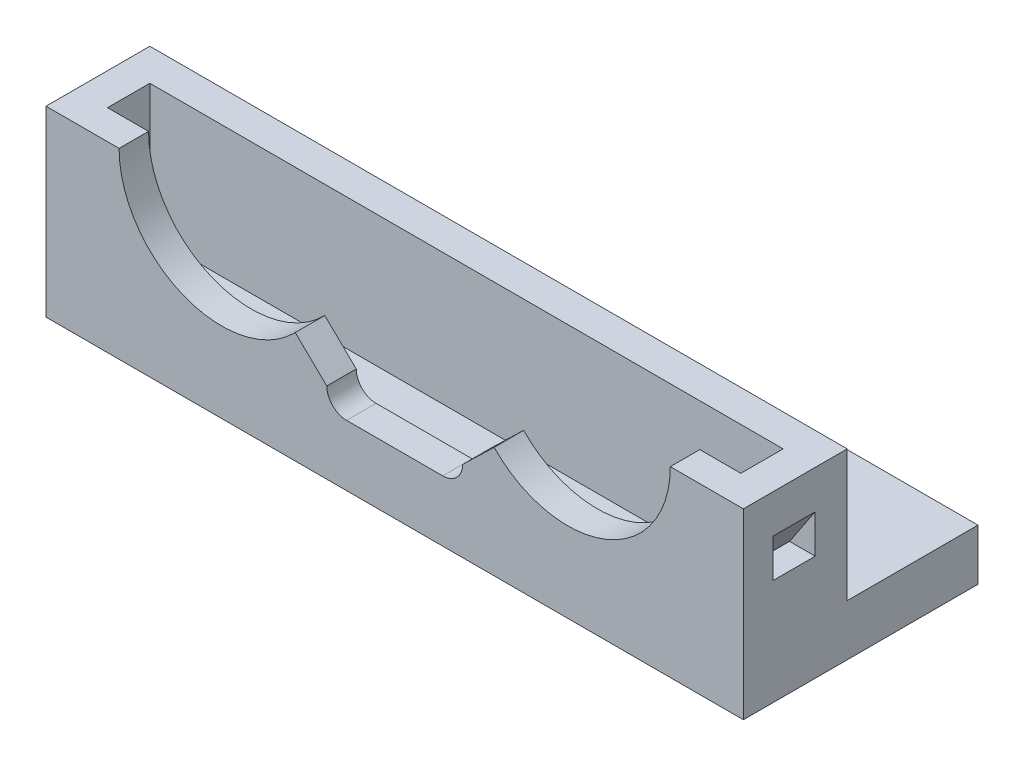
ISO-10303-21;
HEADER;
FILE_DESCRIPTION(('STEP AP214'),'2;1');
FILE_NAME('part.step','',(''),(''),'','','');
FILE_SCHEMA(('AUTOMOTIVE_DESIGN { 1 0 10303 214 1 1 1 1 }'));
ENDSEC;
DATA;
#1=APPLICATION_CONTEXT('core data for automotive mechanical design processes');
#2=APPLICATION_PROTOCOL_DEFINITION('international standard','automotive_design',2000,#1);
#3=PRODUCT_CONTEXT('',#1,'mechanical');
#4=PRODUCT('Part','Part','',(#3));
#5=PRODUCT_RELATED_PRODUCT_CATEGORY('part','',(#4));
#6=PRODUCT_DEFINITION_FORMATION('','',#4);
#7=PRODUCT_DEFINITION_CONTEXT('part definition',#1,'design');
#8=PRODUCT_DEFINITION('design','',#6,#7);
#9=PRODUCT_DEFINITION_SHAPE('','',#8);
#10=(LENGTH_UNIT() NAMED_UNIT(*) SI_UNIT(.MILLI.,.METRE.));
#11=(NAMED_UNIT(*) PLANE_ANGLE_UNIT() SI_UNIT($,.RADIAN.));
#12=(NAMED_UNIT(*) SI_UNIT($,.STERADIAN.) SOLID_ANGLE_UNIT());
#13=UNCERTAINTY_MEASURE_WITH_UNIT(LENGTH_MEASURE(1.E-05),#10,'distance_accuracy_value','');
#14=(GEOMETRIC_REPRESENTATION_CONTEXT(3) GLOBAL_UNCERTAINTY_ASSIGNED_CONTEXT((#13)) GLOBAL_UNIT_ASSIGNED_CONTEXT((#10,
#11,#12)) REPRESENTATION_CONTEXT('',''));
#15=CARTESIAN_POINT('',(0.,0.,0.));
#16=DIRECTION('',(0.,0.,1.));
#17=DIRECTION('',(1.,0.,0.));
#18=AXIS2_PLACEMENT_3D('',#15,#16,#17);
#19=CARTESIAN_POINT('',(-27.2,4.,8.));
#20=DIRECTION('',(1.,0.,0.));
#21=DIRECTION('',(0.,0.,-1.));
#22=AXIS2_PLACEMENT_3D('',#19,#20,#21);
#23=PLANE('',#22);
#24=DIRECTION('',(0.,0.,-1.));
#25=VECTOR('',#24,1.);
#26=CARTESIAN_POINT('',(-27.2,14.25,8.));
#27=LINE('',#26,#25);
#28=CARTESIAN_POINT('',(-27.2,14.25,10.3));
#29=VERTEX_POINT('',#28);
#30=CARTESIAN_POINT('',(-27.2,14.25,2.2));
#31=VERTEX_POINT('',#30);
#32=EDGE_CURVE('E305',#29,#31,#27,.T.);
#33=ORIENTED_EDGE('',*,*,#32,.T.);
#34=DIRECTION('',(0.,1.,0.));
#35=VECTOR('',#34,1.);
#36=CARTESIAN_POINT('',(-27.2,14.25,2.2));
#37=LINE('',#36,#35);
#38=CARTESIAN_POINT('',(-27.2,4.,2.2));
#39=VERTEX_POINT('',#38);
#40=EDGE_CURVE('E265',#39,#31,#37,.T.);
#41=ORIENTED_EDGE('',*,*,#40,.F.);
#42=DIRECTION('',(0.,0.,1.));
#43=VECTOR('',#42,1.);
#44=CARTESIAN_POINT('',(-27.2,4.,8.));
#45=LINE('',#44,#43);
#46=CARTESIAN_POINT('',(-27.2,4.,-8.));
#47=VERTEX_POINT('',#46);
#48=EDGE_CURVE('E358',#47,#39,#45,.T.);
#49=ORIENTED_EDGE('',*,*,#48,.F.);
#50=DIRECTION('',(0.,-1.,0.));
#51=VECTOR('',#50,1.);
#52=CARTESIAN_POINT('',(-27.2,4.,-8.));
#53=LINE('',#52,#51);
#54=CARTESIAN_POINT('',(-27.2,0.,-8.));
#55=VERTEX_POINT('',#54);
#56=EDGE_CURVE('E369',#47,#55,#53,.T.);
#57=ORIENTED_EDGE('',*,*,#56,.T.);
#58=DIRECTION('',(0.,0.,1.));
#59=VECTOR('',#58,1.);
#60=CARTESIAN_POINT('',(-27.2,0.,8.));
#61=LINE('',#60,#59);
#62=CARTESIAN_POINT('',(-27.2,0.,10.3));
#63=VERTEX_POINT('',#62);
#64=EDGE_CURVE('E366',#55,#63,#61,.T.);
#65=ORIENTED_EDGE('',*,*,#64,.T.);
#66=DIRECTION('',(0.,-1.,0.));
#67=VECTOR('',#66,1.);
#68=CARTESIAN_POINT('',(-27.2,0.,10.3));
#69=LINE('',#68,#67);
#70=EDGE_CURVE('E349',#29,#63,#69,.T.);
#71=ORIENTED_EDGE('',*,*,#70,.F.);
#72=EDGE_LOOP('',(#33,#41,#49,#57,#65,#71));
#73=FACE_BOUND('',#72,.T.);
#74=DIRECTION('',(0.,-1.,0.));
#75=VECTOR('',#74,1.);
#76=CARTESIAN_POINT('',(-27.2,11.25,8.));
#77=LINE('',#76,#75);
#78=CARTESIAN_POINT('',(-27.2,11.25,8.));
#79=VERTEX_POINT('',#78);
#80=CARTESIAN_POINT('',(-27.2,8.25,8.));
#81=VERTEX_POINT('',#80);
#82=EDGE_CURVE('E199',#79,#81,#77,.T.);
#83=ORIENTED_EDGE('',*,*,#82,.T.);
#84=DIRECTION('',(0.,0.,-1.));
#85=VECTOR('',#84,1.);
#86=CARTESIAN_POINT('',(-27.2,8.25,8.));
#87=LINE('',#86,#85);
#88=CARTESIAN_POINT('',(-27.2,8.25,4.7));
#89=VERTEX_POINT('',#88);
#90=EDGE_CURVE('E219',#81,#89,#87,.T.);
#91=ORIENTED_EDGE('',*,*,#90,.T.);
#92=DIRECTION('',(0.,-1.,0.));
#93=VECTOR('',#92,1.);
#94=CARTESIAN_POINT('',(-27.2,11.25,4.7));
#95=LINE('',#94,#93);
#96=CARTESIAN_POINT('',(-27.2,11.25,4.7));
#97=VERTEX_POINT('',#96);
#98=EDGE_CURVE('E217',#97,#89,#95,.T.);
#99=ORIENTED_EDGE('',*,*,#98,.F.);
#100=DIRECTION('',(0.,0.,-1.));
#101=VECTOR('',#100,1.);
#102=CARTESIAN_POINT('',(-27.2,11.25,8.));
#103=LINE('',#102,#101);
#104=EDGE_CURVE('E211',#79,#97,#103,.T.);
#105=ORIENTED_EDGE('',*,*,#104,.F.);
#106=EDGE_LOOP('',(#83,#91,#99,#105));
#107=FACE_BOUND('',#106,.T.);
#108=ADVANCED_FACE('F34',(#73,#107),#23,.F.);
#109=CARTESIAN_POINT('',(0.,4.,0.));
#110=DIRECTION('',(0.,-1.,0.));
#111=DIRECTION('',(0.,0.,-1.));
#112=AXIS2_PLACEMENT_3D('',#109,#110,#111);
#113=PLANE('',#112);
#114=DIRECTION('',(0.,0.,1.));
#115=VECTOR('',#114,1.);
#116=CARTESIAN_POINT('',(24.7,4.,4.7));
#117=LINE('',#116,#115);
#118=CARTESIAN_POINT('',(24.7,4.,4.7));
#119=VERTEX_POINT('',#118);
#120=CARTESIAN_POINT('',(24.7,4.,8.));
#121=VERTEX_POINT('',#120);
#122=EDGE_CURVE('E245',#119,#121,#117,.T.);
#123=ORIENTED_EDGE('',*,*,#122,.F.);
#124=DIRECTION('',(1.,0.,0.));
#125=VECTOR('',#124,1.);
#126=CARTESIAN_POINT('',(-27.2,4.,4.7));
#127=LINE('',#126,#125);
#128=CARTESIAN_POINT('',(-24.7,4.,4.7));
#129=VERTEX_POINT('',#128);
#130=EDGE_CURVE('E275',#129,#119,#127,.T.);
#131=ORIENTED_EDGE('',*,*,#130,.F.);
#132=DIRECTION('',(0.,0.,-1.));
#133=VECTOR('',#132,1.);
#134=CARTESIAN_POINT('',(-24.7,4.,4.7));
#135=LINE('',#134,#133);
#136=CARTESIAN_POINT('',(-24.7,4.,8.));
#137=VERTEX_POINT('',#136);
#138=EDGE_CURVE('E254',#137,#129,#135,.T.);
#139=ORIENTED_EDGE('',*,*,#138,.F.);
#140=DIRECTION('',(1.,0.,0.));
#141=VECTOR('',#140,1.);
#142=CARTESIAN_POINT('',(-27.2,4.,8.));
#143=LINE('',#142,#141);
#144=EDGE_CURVE('E38',#137,#121,#143,.T.);
#145=ORIENTED_EDGE('',*,*,#144,.T.);
#146=EDGE_LOOP('',(#123,#131,#139,#145));
#147=FACE_BOUND('',#146,.T.);
#148=ADVANCED_FACE('F476',(#147),#113,.F.);
#149=CARTESIAN_POINT('',(-27.2,0.,8.));
#150=DIRECTION('',(0.,0.,-1.));
#151=DIRECTION('',(-1.,0.,0.));
#152=AXIS2_PLACEMENT_3D('',#149,#150,#151);
#153=PLANE('',#152);
#154=DIRECTION('',(-1.,0.,0.));
#155=VECTOR('',#154,1.);
#156=CARTESIAN_POINT('',(-27.2,14.25,8.));
#157=LINE('',#156,#155);
#158=CARTESIAN_POINT('',(24.7,14.25,8.));
#159=VERTEX_POINT('',#158);
#160=CARTESIAN_POINT('',(21.5,14.25,8.));
#161=VERTEX_POINT('',#160);
#162=EDGE_CURVE('E297',#159,#161,#157,.T.);
#163=ORIENTED_EDGE('',*,*,#162,.F.);
#164=DIRECTION('',(0.,-1.,0.));
#165=VECTOR('',#164,1.);
#166=CARTESIAN_POINT('',(24.7,14.25,8.));
#167=LINE('',#166,#165);
#168=EDGE_CURVE('E251',#159,#121,#167,.T.);
#169=ORIENTED_EDGE('',*,*,#168,.T.);
#170=ORIENTED_EDGE('',*,*,#144,.F.);
#171=DIRECTION('',(0.,-1.,0.));
#172=VECTOR('',#171,1.);
#173=CARTESIAN_POINT('',(-24.7,14.25,8.));
#174=LINE('',#173,#172);
#175=CARTESIAN_POINT('',(-24.7,14.25,8.));
#176=VERTEX_POINT('',#175);
#177=EDGE_CURVE('E258',#176,#137,#174,.T.);
#178=ORIENTED_EDGE('',*,*,#177,.F.);
#179=DIRECTION('',(-1.,0.,0.));
#180=VECTOR('',#179,1.);
#181=CARTESIAN_POINT('',(-27.2,14.25,8.));
#182=LINE('',#181,#180);
#183=CARTESIAN_POINT('',(-21.5,14.25,8.));
#184=VERTEX_POINT('',#183);
#185=EDGE_CURVE('E302',#184,#176,#182,.T.);
#186=ORIENTED_EDGE('',*,*,#185,.F.);
#187=CARTESIAN_POINT('',(-13.5,14.25,8.));
#188=DIRECTION('',(0.,0.,-1.));
#189=DIRECTION('',(-1.,0.,0.));
#190=AXIS2_PLACEMENT_3D('',#187,#188,#189);
#191=CIRCLE('',#190,8.);
#192=CARTESIAN_POINT('',(-7.75626648161275,8.68138030839285,8.));
#193=VERTEX_POINT('',#192);
#194=EDGE_CURVE('E318',#193,#184,#191,.T.);
#195=ORIENTED_EDGE('',*,*,#194,.F.);
#196=DIRECTION('',(-0.717966689798405,0.696077461450894,0.));
#197=VECTOR('',#196,1.);
#198=CARTESIAN_POINT('',(-13.4404373574563,14.1922532916802,8.));
#199=LINE('',#198,#197);
#200=CARTESIAN_POINT('',(-5.3,6.3,8.));
#201=VERTEX_POINT('',#200);
#202=EDGE_CURVE('E307',#201,#193,#199,.T.);
#203=ORIENTED_EDGE('',*,*,#202,.F.);
#204=CARTESIAN_POINT('',(-3.75,6.3,8.));
#205=DIRECTION('',(0.,0.,-1.));
#206=DIRECTION('',(-1.,0.,0.));
#207=AXIS2_PLACEMENT_3D('',#204,#205,#206);
#208=CIRCLE('',#207,1.55);
#209=CARTESIAN_POINT('',(-3.75,4.75,8.));
#210=VERTEX_POINT('',#209);
#211=EDGE_CURVE('E338',#210,#201,#208,.T.);
#212=ORIENTED_EDGE('',*,*,#211,.F.);
#213=DIRECTION('',(-1.,0.,0.));
#214=VECTOR('',#213,1.);
#215=CARTESIAN_POINT('',(-27.2,4.75,8.));
#216=LINE('',#215,#214);
#217=CARTESIAN_POINT('',(3.75,4.75,8.));
#218=VERTEX_POINT('',#217);
#219=EDGE_CURVE('E332',#218,#210,#216,.T.);
#220=ORIENTED_EDGE('',*,*,#219,.F.);
#221=CARTESIAN_POINT('',(3.75,6.3,8.));
#222=DIRECTION('',(0.,0.,-1.));
#223=DIRECTION('',(-1.,0.,0.));
#224=AXIS2_PLACEMENT_3D('',#221,#222,#223);
#225=CIRCLE('',#224,1.55);
#226=CARTESIAN_POINT('',(5.3,6.3,8.));
#227=VERTEX_POINT('',#226);
#228=EDGE_CURVE('E336',#227,#218,#225,.T.);
#229=ORIENTED_EDGE('',*,*,#228,.F.);
#230=DIRECTION('',(-0.717966689798406,-0.696077461450893,0.));
#231=VECTOR('',#230,1.);
#232=CARTESIAN_POINT('',(-14.601466163252,-12.9947141460797,8.));
#233=LINE('',#232,#231);
#234=CARTESIAN_POINT('',(7.75626648161275,8.68138030839285,8.));
#235=VERTEX_POINT('',#234);
#236=EDGE_CURVE('E293',#235,#227,#233,.T.);
#237=ORIENTED_EDGE('',*,*,#236,.F.);
#238=CARTESIAN_POINT('',(13.5,14.25,8.));
#239=DIRECTION('',(0.,0.,-1.));
#240=DIRECTION('',(-1.,0.,0.));
#241=AXIS2_PLACEMENT_3D('',#238,#239,#240);
#242=CIRCLE('',#241,8.00000000000001);
#243=EDGE_CURVE('E312',#161,#235,#242,.T.);
#244=ORIENTED_EDGE('',*,*,#243,.F.);
#245=EDGE_LOOP('',(#163,#169,#170,#178,#186,#195,#203,#212,#220,#229,#237,#244));
#246=FACE_BOUND('',#245,.T.);
#247=ADVANCED_FACE('F441',(#246),#153,.T.);
#248=CARTESIAN_POINT('',(-27.2,14.25,4.7));
#249=DIRECTION('',(0.,0.,1.));
#250=DIRECTION('',(0.,-1.,0.));
#251=AXIS2_PLACEMENT_3D('',#248,#249,#250);
#252=PLANE('',#251);
#253=ORIENTED_EDGE('',*,*,#130,.T.);
#254=DIRECTION('',(0.,-1.,0.));
#255=VECTOR('',#254,1.);
#256=CARTESIAN_POINT('',(24.7,14.25,4.7));
#257=LINE('',#256,#255);
#258=CARTESIAN_POINT('',(24.7,14.25,4.7));
#259=VERTEX_POINT('',#258);
#260=EDGE_CURVE('E248',#259,#119,#257,.T.);
#261=ORIENTED_EDGE('',*,*,#260,.F.);
#262=DIRECTION('',(1.,0.,0.));
#263=VECTOR('',#262,1.);
#264=CARTESIAN_POINT('',(-27.2,14.25,4.7));
#265=LINE('',#264,#263);
#266=CARTESIAN_POINT('',(-24.7,14.25,4.7));
#267=VERTEX_POINT('',#266);
#268=EDGE_CURVE('E278',#267,#259,#265,.T.);
#269=ORIENTED_EDGE('',*,*,#268,.F.);
#270=DIRECTION('',(0.,-1.,0.));
#271=VECTOR('',#270,1.);
#272=CARTESIAN_POINT('',(-24.7,14.25,4.7));
#273=LINE('',#272,#271);
#274=EDGE_CURVE('E261',#267,#129,#273,.T.);
#275=ORIENTED_EDGE('',*,*,#274,.T.);
#276=EDGE_LOOP('',(#253,#261,#269,#275));
#277=FACE_BOUND('',#276,.T.);
#278=ADVANCED_FACE('F468',(#277),#252,.T.);
#279=CARTESIAN_POINT('',(-13.5,4.,-2.5));
#280=DIRECTION('',(0.,1.,0.));
#281=DIRECTION('',(0.,0.,1.));
#282=AXIS2_PLACEMENT_3D('',#279,#280,#281);
#283=CIRCLE('',#282,2.3);
#284=CARTESIAN_POINT('',(-13.5,4.,-0.200000000000001));
#285=VERTEX_POINT('',#284);
#286=EDGE_CURVE('E345',#285,#285,#283,.T.);
#287=ORIENTED_EDGE('',*,*,#286,.F.);
#288=EDGE_LOOP('',(#287));
#289=FACE_BOUND('',#288,.T.);
#290=CARTESIAN_POINT('',(13.5,4.,-2.5));
#291=DIRECTION('',(0.,1.,0.));
#292=DIRECTION('',(0.,0.,1.));
#293=AXIS2_PLACEMENT_3D('',#290,#291,#292);
#294=CIRCLE('',#293,2.3);
#295=CARTESIAN_POINT('',(13.5,4.,-0.200000000000003));
#296=VERTEX_POINT('',#295);
#297=EDGE_CURVE('E341',#296,#296,#294,.T.);
#298=ORIENTED_EDGE('',*,*,#297,.F.);
#299=EDGE_LOOP('',(#298));
#300=FACE_BOUND('',#299,.T.);
#301=ORIENTED_EDGE('',*,*,#48,.T.);
#302=DIRECTION('',(1.,0.,0.));
#303=VECTOR('',#302,1.);
#304=CARTESIAN_POINT('',(-27.2,4.,2.2));
#305=LINE('',#304,#303);
#306=CARTESIAN_POINT('',(27.2,4.,2.2));
#307=VERTEX_POINT('',#306);
#308=EDGE_CURVE('E271',#39,#307,#305,.T.);
#309=ORIENTED_EDGE('',*,*,#308,.T.);
#310=DIRECTION('',(0.,0.,-1.));
#311=VECTOR('',#310,1.);
#312=CARTESIAN_POINT('',(27.2,4.,8.));
#313=LINE('',#312,#311);
#314=CARTESIAN_POINT('',(27.2,4.,-8.));
#315=VERTEX_POINT('',#314);
#316=EDGE_CURVE('E359',#307,#315,#313,.T.);
#317=ORIENTED_EDGE('',*,*,#316,.T.);
#318=DIRECTION('',(-1.,0.,0.));
#319=VECTOR('',#318,1.);
#320=CARTESIAN_POINT('',(-27.2,4.,-8.));
#321=LINE('',#320,#319);
#322=EDGE_CURVE('E357',#315,#47,#321,.T.);
#323=ORIENTED_EDGE('',*,*,#322,.T.);
#324=EDGE_LOOP('',(#301,#309,#317,#323));
#325=FACE_BOUND('',#324,.T.);
#326=ADVANCED_FACE('F423',(#289,#300,#325),#113,.F.);
#327=CARTESIAN_POINT('',(27.2,4.,8.));
#328=DIRECTION('',(-1.,0.,0.));
#329=DIRECTION('',(0.,0.,1.));
#330=AXIS2_PLACEMENT_3D('',#327,#328,#329);
#331=PLANE('',#330);
#332=DIRECTION('',(0.,0.,-1.));
#333=VECTOR('',#332,1.);
#334=CARTESIAN_POINT('',(27.2,8.25,8.));
#335=LINE('',#334,#333);
#336=CARTESIAN_POINT('',(27.2,8.25,8.));
#337=VERTEX_POINT('',#336);
#338=CARTESIAN_POINT('',(27.2,8.25,4.7));
#339=VERTEX_POINT('',#338);
#340=EDGE_CURVE('E60',#337,#339,#335,.T.);
#341=ORIENTED_EDGE('',*,*,#340,.F.);
#342=DIRECTION('',(0.,1.,0.));
#343=VECTOR('',#342,1.);
#344=CARTESIAN_POINT('',(27.2,11.25,8.));
#345=LINE('',#344,#343);
#346=CARTESIAN_POINT('',(27.2,11.25,8.));
#347=VERTEX_POINT('',#346);
#348=EDGE_CURVE('E233',#337,#347,#345,.T.);
#349=ORIENTED_EDGE('',*,*,#348,.T.);
#350=DIRECTION('',(0.,0.,-1.));
#351=VECTOR('',#350,1.);
#352=CARTESIAN_POINT('',(27.2,11.25,8.));
#353=LINE('',#352,#351);
#354=CARTESIAN_POINT('',(27.2,11.25,4.7));
#355=VERTEX_POINT('',#354);
#356=EDGE_CURVE('E235',#347,#355,#353,.T.);
#357=ORIENTED_EDGE('',*,*,#356,.T.);
#358=DIRECTION('',(0.,1.,0.));
#359=VECTOR('',#358,1.);
#360=CARTESIAN_POINT('',(27.2,11.25,4.7));
#361=LINE('',#360,#359);
#362=EDGE_CURVE('E231',#339,#355,#361,.T.);
#363=ORIENTED_EDGE('',*,*,#362,.F.);
#364=EDGE_LOOP('',(#341,#349,#357,#363));
#365=FACE_BOUND('',#364,.T.);
#366=DIRECTION('',(0.,1.,0.));
#367=VECTOR('',#366,1.);
#368=CARTESIAN_POINT('',(27.2,14.25,2.2));
#369=LINE('',#368,#367);
#370=CARTESIAN_POINT('',(27.2,14.25,2.2));
#371=VERTEX_POINT('',#370);
#372=EDGE_CURVE('E264',#307,#371,#369,.T.);
#373=ORIENTED_EDGE('',*,*,#372,.T.);
#374=DIRECTION('',(0.,0.,1.));
#375=VECTOR('',#374,1.);
#376=CARTESIAN_POINT('',(27.2,14.25,8.));
#377=LINE('',#376,#375);
#378=CARTESIAN_POINT('',(27.2,14.25,10.3));
#379=VERTEX_POINT('',#378);
#380=EDGE_CURVE('E299',#371,#379,#377,.T.);
#381=ORIENTED_EDGE('',*,*,#380,.T.);
#382=DIRECTION('',(0.,-1.,0.));
#383=VECTOR('',#382,1.);
#384=CARTESIAN_POINT('',(27.2,0.,10.3));
#385=LINE('',#384,#383);
#386=CARTESIAN_POINT('',(27.2,0.,10.3));
#387=VERTEX_POINT('',#386);
#388=EDGE_CURVE('E352',#379,#387,#385,.T.);
#389=ORIENTED_EDGE('',*,*,#388,.T.);
#390=DIRECTION('',(0.,0.,-1.));
#391=VECTOR('',#390,1.);
#392=CARTESIAN_POINT('',(27.2,0.,8.));
#393=LINE('',#392,#391);
#394=CARTESIAN_POINT('',(27.2,0.,-8.));
#395=VERTEX_POINT('',#394);
#396=EDGE_CURVE('E356',#387,#395,#393,.T.);
#397=ORIENTED_EDGE('',*,*,#396,.T.);
#398=DIRECTION('',(0.,-1.,0.));
#399=VECTOR('',#398,1.);
#400=CARTESIAN_POINT('',(27.2,4.,-8.));
#401=LINE('',#400,#399);
#402=EDGE_CURVE('E372',#315,#395,#401,.T.);
#403=ORIENTED_EDGE('',*,*,#402,.F.);
#404=ORIENTED_EDGE('',*,*,#316,.F.);
#405=EDGE_LOOP('',(#373,#381,#389,#397,#403,#404));
#406=FACE_BOUND('',#405,.T.);
#407=ADVANCED_FACE('F36',(#365,#406),#331,.F.);
#408=CARTESIAN_POINT('',(-27.2,4.,-8.));
#409=DIRECTION('',(0.,0.,1.));
#410=DIRECTION('',(1.,0.,0.));
#411=AXIS2_PLACEMENT_3D('',#408,#409,#410);
#412=PLANE('',#411);
#413=DIRECTION('',(-1.,0.,0.));
#414=VECTOR('',#413,1.);
#415=CARTESIAN_POINT('',(-27.2,0.,-8.));
#416=LINE('',#415,#414);
#417=EDGE_CURVE('E364',#395,#55,#416,.T.);
#418=ORIENTED_EDGE('',*,*,#417,.T.);
#419=ORIENTED_EDGE('',*,*,#56,.F.);
#420=ORIENTED_EDGE('',*,*,#322,.F.);
#421=ORIENTED_EDGE('',*,*,#402,.T.);
#422=EDGE_LOOP('',(#418,#419,#420,#421));
#423=FACE_BOUND('',#422,.T.);
#424=ADVANCED_FACE('F400',(#423),#412,.F.);
#425=CARTESIAN_POINT('',(0.,0.,0.));
#426=DIRECTION('',(0.,-1.,0.));
#427=DIRECTION('',(0.,0.,-1.));
#428=AXIS2_PLACEMENT_3D('',#425,#426,#427);
#429=PLANE('',#428);
#430=CARTESIAN_POINT('',(13.5,0.,-2.5));
#431=DIRECTION('',(0.,-1.,0.));
#432=DIRECTION('',(0.,0.,-1.));
#433=AXIS2_PLACEMENT_3D('',#430,#431,#432);
#434=CIRCLE('',#433,2.3);
#435=CARTESIAN_POINT('',(13.5,0.,-4.8));
#436=VERTEX_POINT('',#435);
#437=EDGE_CURVE('E344',#436,#436,#434,.T.);
#438=ORIENTED_EDGE('',*,*,#437,.F.);
#439=EDGE_LOOP('',(#438));
#440=FACE_BOUND('',#439,.T.);
#441=CARTESIAN_POINT('',(-13.5,0.,-2.5));
#442=DIRECTION('',(0.,-1.,0.));
#443=DIRECTION('',(0.,0.,-1.));
#444=AXIS2_PLACEMENT_3D('',#441,#442,#443);
#445=CIRCLE('',#444,2.3);
#446=CARTESIAN_POINT('',(-13.5,0.,-4.8));
#447=VERTEX_POINT('',#446);
#448=EDGE_CURVE('E348',#447,#447,#445,.T.);
#449=ORIENTED_EDGE('',*,*,#448,.F.);
#450=EDGE_LOOP('',(#449));
#451=FACE_BOUND('',#450,.T.);
#452=ORIENTED_EDGE('',*,*,#396,.F.);
#453=DIRECTION('',(1.,0.,0.));
#454=VECTOR('',#453,1.);
#455=CARTESIAN_POINT('',(-27.2,0.,10.3));
#456=LINE('',#455,#454);
#457=EDGE_CURVE('E351',#63,#387,#456,.T.);
#458=ORIENTED_EDGE('',*,*,#457,.F.);
#459=ORIENTED_EDGE('',*,*,#64,.F.);
#460=ORIENTED_EDGE('',*,*,#417,.F.);
#461=EDGE_LOOP('',(#452,#458,#459,#460));
#462=FACE_BOUND('',#461,.T.);
#463=ADVANCED_FACE('F396',(#440,#451,#462),#429,.T.);
#464=CARTESIAN_POINT('',(-27.2,0.,10.3));
#465=DIRECTION('',(0.,0.,1.));
#466=DIRECTION('',(1.,0.,0.));
#467=AXIS2_PLACEMENT_3D('',#464,#465,#466);
#468=PLANE('',#467);
#469=DIRECTION('',(1.,0.,0.));
#470=VECTOR('',#469,1.);
#471=CARTESIAN_POINT('',(21.5,14.25,10.3));
#472=LINE('',#471,#470);
#473=CARTESIAN_POINT('',(21.5,14.25,10.3));
#474=VERTEX_POINT('',#473);
#475=EDGE_CURVE('E288',#474,#379,#472,.T.);
#476=ORIENTED_EDGE('',*,*,#475,.F.);
#477=CARTESIAN_POINT('',(13.5,14.25,10.3));
#478=DIRECTION('',(0.,0.,1.));
#479=DIRECTION('',(1.,0.,0.));
#480=AXIS2_PLACEMENT_3D('',#477,#478,#479);
#481=CIRCLE('',#480,8.00000000000001);
#482=CARTESIAN_POINT('',(7.75626648161275,8.68138030839285,10.3));
#483=VERTEX_POINT('',#482);
#484=EDGE_CURVE('E309',#483,#474,#481,.T.);
#485=ORIENTED_EDGE('',*,*,#484,.F.);
#486=DIRECTION('',(0.717966689798406,0.696077461450893,0.));
#487=VECTOR('',#486,1.);
#488=CARTESIAN_POINT('',(5.3,6.3,10.3));
#489=LINE('',#488,#487);
#490=CARTESIAN_POINT('',(5.3,6.3,10.3));
#491=VERTEX_POINT('',#490);
#492=EDGE_CURVE('E286',#491,#483,#489,.T.);
#493=ORIENTED_EDGE('',*,*,#492,.F.);
#494=CARTESIAN_POINT('',(3.75,6.3,10.3));
#495=DIRECTION('',(0.,0.,1.));
#496=DIRECTION('',(1.,0.,0.));
#497=AXIS2_PLACEMENT_3D('',#494,#495,#496);
#498=CIRCLE('',#497,1.55);
#499=CARTESIAN_POINT('',(3.75,4.75,10.3));
#500=VERTEX_POINT('',#499);
#501=EDGE_CURVE('E326',#500,#491,#498,.T.);
#502=ORIENTED_EDGE('',*,*,#501,.F.);
#503=DIRECTION('',(1.,0.,0.));
#504=VECTOR('',#503,1.);
#505=CARTESIAN_POINT('',(-3.75,4.75,10.3));
#506=LINE('',#505,#504);
#507=CARTESIAN_POINT('',(-3.75,4.75,10.3));
#508=VERTEX_POINT('',#507);
#509=EDGE_CURVE('E323',#508,#500,#506,.T.);
#510=ORIENTED_EDGE('',*,*,#509,.F.);
#511=CARTESIAN_POINT('',(-3.75,6.3,10.3));
#512=DIRECTION('',(0.,0.,1.));
#513=DIRECTION('',(1.,0.,0.));
#514=AXIS2_PLACEMENT_3D('',#511,#512,#513);
#515=CIRCLE('',#514,1.55);
#516=CARTESIAN_POINT('',(-5.3,6.3,10.3));
#517=VERTEX_POINT('',#516);
#518=EDGE_CURVE('E321',#517,#508,#515,.T.);
#519=ORIENTED_EDGE('',*,*,#518,.F.);
#520=DIRECTION('',(0.717966689798405,-0.696077461450894,0.));
#521=VECTOR('',#520,1.);
#522=CARTESIAN_POINT('',(-5.3,6.3,10.3));
#523=LINE('',#522,#521);
#524=CARTESIAN_POINT('',(-7.75626648161275,8.68138030839285,10.3));
#525=VERTEX_POINT('',#524);
#526=EDGE_CURVE('E284',#525,#517,#523,.T.);
#527=ORIENTED_EDGE('',*,*,#526,.F.);
#528=CARTESIAN_POINT('',(-13.5,14.25,10.3));
#529=DIRECTION('',(0.,0.,1.));
#530=DIRECTION('',(1.,0.,0.));
#531=AXIS2_PLACEMENT_3D('',#528,#529,#530);
#532=CIRCLE('',#531,8.);
#533=CARTESIAN_POINT('',(-21.5,14.25,10.3));
#534=VERTEX_POINT('',#533);
#535=EDGE_CURVE('E315',#534,#525,#532,.T.);
#536=ORIENTED_EDGE('',*,*,#535,.F.);
#537=DIRECTION('',(1.,0.,0.));
#538=VECTOR('',#537,1.);
#539=CARTESIAN_POINT('',(-35.2426989300947,14.25,10.3));
#540=LINE('',#539,#538);
#541=EDGE_CURVE('E274',#29,#534,#540,.T.);
#542=ORIENTED_EDGE('',*,*,#541,.F.);
#543=ORIENTED_EDGE('',*,*,#70,.T.);
#544=ORIENTED_EDGE('',*,*,#457,.T.);
#545=ORIENTED_EDGE('',*,*,#388,.F.);
#546=EDGE_LOOP('',(#476,#485,#493,#502,#510,#519,#527,#536,#542,#543,#544,#545));
#547=FACE_BOUND('',#546,.T.);
#548=ADVANCED_FACE('F399',(#547),#468,.T.);
#549=CARTESIAN_POINT('',(-13.5,-41.,-2.5));
#550=DIRECTION('',(0.,1.,0.));
#551=DIRECTION('',(0.,0.,1.));
#552=AXIS2_PLACEMENT_3D('',#549,#550,#551);
#553=CYLINDRICAL_SURFACE('',#552,2.3);
#554=ORIENTED_EDGE('',*,*,#448,.T.);
#555=EDGE_LOOP('',(#554));
#556=FACE_BOUND('',#555,.T.);
#557=ORIENTED_EDGE('',*,*,#286,.T.);
#558=EDGE_LOOP('',(#557));
#559=FACE_BOUND('',#558,.T.);
#560=ADVANCED_FACE('F393',(#556,#559),#553,.F.);
#561=CARTESIAN_POINT('',(13.5,-41.,-2.5));
#562=DIRECTION('',(0.,1.,0.));
#563=DIRECTION('',(0.,0.,1.));
#564=AXIS2_PLACEMENT_3D('',#561,#562,#563);
#565=CYLINDRICAL_SURFACE('',#564,2.3);
#566=ORIENTED_EDGE('',*,*,#437,.T.);
#567=EDGE_LOOP('',(#566));
#568=FACE_BOUND('',#567,.T.);
#569=ORIENTED_EDGE('',*,*,#297,.T.);
#570=EDGE_LOOP('',(#569));
#571=FACE_BOUND('',#570,.T.);
#572=ADVANCED_FACE('F716',(#568,#571),#565,.F.);
#573=CARTESIAN_POINT('',(-3.75,6.3,0.299999999999998));
#574=DIRECTION('',(0.,0.,1.));
#575=DIRECTION('',(1.,0.,0.));
#576=AXIS2_PLACEMENT_3D('',#573,#574,#575);
#577=CYLINDRICAL_SURFACE('',#576,1.55);
#578=ORIENTED_EDGE('',*,*,#211,.T.);
#579=DIRECTION('',(0.,0.,1.));
#580=VECTOR('',#579,1.);
#581=CARTESIAN_POINT('',(-5.3,6.3,0.299999999999998));
#582=LINE('',#581,#580);
#583=EDGE_CURVE('E290',#201,#517,#582,.T.);
#584=ORIENTED_EDGE('',*,*,#583,.T.);
#585=ORIENTED_EDGE('',*,*,#518,.T.);
#586=DIRECTION('',(0.,0.,1.));
#587=VECTOR('',#586,1.);
#588=CARTESIAN_POINT('',(-3.75,4.75,0.299999999999998));
#589=LINE('',#588,#587);
#590=EDGE_CURVE('E329',#210,#508,#589,.T.);
#591=ORIENTED_EDGE('',*,*,#590,.F.);
#592=EDGE_LOOP('',(#578,#584,#585,#591));
#593=FACE_BOUND('',#592,.T.);
#594=ADVANCED_FACE('F455',(#593),#577,.F.);
#595=CARTESIAN_POINT('',(3.75,6.3,0.299999999999998));
#596=DIRECTION('',(0.,0.,1.));
#597=DIRECTION('',(1.,0.,0.));
#598=AXIS2_PLACEMENT_3D('',#595,#596,#597);
#599=CYLINDRICAL_SURFACE('',#598,1.55);
#600=ORIENTED_EDGE('',*,*,#501,.T.);
#601=DIRECTION('',(0.,0.,1.));
#602=VECTOR('',#601,1.);
#603=CARTESIAN_POINT('',(5.3,6.3,0.299999999999998));
#604=LINE('',#603,#602);
#605=EDGE_CURVE('E291',#227,#491,#604,.T.);
#606=ORIENTED_EDGE('',*,*,#605,.F.);
#607=ORIENTED_EDGE('',*,*,#228,.T.);
#608=DIRECTION('',(0.,0.,1.));
#609=VECTOR('',#608,1.);
#610=CARTESIAN_POINT('',(3.75,4.75,0.299999999999998));
#611=LINE('',#610,#609);
#612=EDGE_CURVE('E330',#218,#500,#611,.T.);
#613=ORIENTED_EDGE('',*,*,#612,.T.);
#614=EDGE_LOOP('',(#600,#606,#607,#613));
#615=FACE_BOUND('',#614,.T.);
#616=ADVANCED_FACE('F446',(#615),#599,.F.);
#617=CARTESIAN_POINT('',(-3.75,4.75,0.299999999999998));
#618=DIRECTION('',(0.,-1.,0.));
#619=DIRECTION('',(1.,0.,0.));
#620=AXIS2_PLACEMENT_3D('',#617,#618,#619);
#621=PLANE('',#620);
#622=ORIENTED_EDGE('',*,*,#219,.T.);
#623=ORIENTED_EDGE('',*,*,#590,.T.);
#624=ORIENTED_EDGE('',*,*,#509,.T.);
#625=ORIENTED_EDGE('',*,*,#612,.F.);
#626=EDGE_LOOP('',(#622,#623,#624,#625));
#627=FACE_BOUND('',#626,.T.);
#628=ADVANCED_FACE('F448',(#627),#621,.F.);
#629=CARTESIAN_POINT('',(-13.5,14.25,0.299999999999998));
#630=DIRECTION('',(0.,0.,1.));
#631=DIRECTION('',(1.,0.,0.));
#632=AXIS2_PLACEMENT_3D('',#629,#630,#631);
#633=CYLINDRICAL_SURFACE('',#632,8.);
#634=ORIENTED_EDGE('',*,*,#535,.T.);
#635=DIRECTION('',(0.,0.,1.));
#636=VECTOR('',#635,1.);
#637=CARTESIAN_POINT('',(-7.75626648161275,8.68138030839285,0.299999999999998));
#638=LINE('',#637,#636);
#639=EDGE_CURVE('E11',#525,#193,#638,.F.);
#640=ORIENTED_EDGE('',*,*,#639,.T.);
#641=ORIENTED_EDGE('',*,*,#194,.T.);
#642=DIRECTION('',(0.,0.,1.));
#643=VECTOR('',#642,1.);
#644=CARTESIAN_POINT('',(-21.5,14.25,0.299999999999998));
#645=LINE('',#644,#643);
#646=EDGE_CURVE('E44',#184,#534,#645,.T.);
#647=ORIENTED_EDGE('',*,*,#646,.T.);
#648=EDGE_LOOP('',(#634,#640,#641,#647));
#649=FACE_BOUND('',#648,.T.);
#650=ADVANCED_FACE('F463',(#649),#633,.F.);
#651=CARTESIAN_POINT('',(13.5,14.25,0.299999999999998));
#652=DIRECTION('',(0.,0.,1.));
#653=DIRECTION('',(1.,0.,0.));
#654=AXIS2_PLACEMENT_3D('',#651,#652,#653);
#655=CYLINDRICAL_SURFACE('',#654,8.00000000000001);
#656=ORIENTED_EDGE('',*,*,#484,.T.);
#657=DIRECTION('',(0.,0.,1.));
#658=VECTOR('',#657,1.);
#659=CARTESIAN_POINT('',(21.5,14.25,0.299999999999998));
#660=LINE('',#659,#658);
#661=EDGE_CURVE('E382',#474,#161,#660,.F.);
#662=ORIENTED_EDGE('',*,*,#661,.T.);
#663=ORIENTED_EDGE('',*,*,#243,.T.);
#664=DIRECTION('',(0.,0.,1.));
#665=VECTOR('',#664,1.);
#666=CARTESIAN_POINT('',(7.75626648161275,8.68138030839285,0.299999999999998));
#667=LINE('',#666,#665);
#668=EDGE_CURVE('E375',#235,#483,#667,.T.);
#669=ORIENTED_EDGE('',*,*,#668,.T.);
#670=EDGE_LOOP('',(#656,#662,#663,#669));
#671=FACE_BOUND('',#670,.T.);
#672=ADVANCED_FACE('F432',(#671),#655,.F.);
#673=CARTESIAN_POINT('',(5.3,6.3,0.299999999999998));
#674=DIRECTION('',(0.696077461450893,-0.717966689798406,0.));
#675=DIRECTION('',(0.717966689798406,0.696077461450893,0.));
#676=AXIS2_PLACEMENT_3D('',#673,#674,#675);
#677=PLANE('',#676);
#678=ORIENTED_EDGE('',*,*,#236,.T.);
#679=ORIENTED_EDGE('',*,*,#605,.T.);
#680=ORIENTED_EDGE('',*,*,#492,.T.);
#681=ORIENTED_EDGE('',*,*,#668,.F.);
#682=EDGE_LOOP('',(#678,#679,#680,#681));
#683=FACE_BOUND('',#682,.T.);
#684=ADVANCED_FACE('F436',(#683),#677,.F.);
#685=CARTESIAN_POINT('',(-35.2426989300947,14.25,0.299999999999998));
#686=DIRECTION('',(0.,-1.,0.));
#687=DIRECTION('',(0.,0.,-1.));
#688=AXIS2_PLACEMENT_3D('',#685,#686,#687);
#689=PLANE('',#688);
#690=ORIENTED_EDGE('',*,*,#541,.T.);
#691=ORIENTED_EDGE('',*,*,#646,.F.);
#692=ORIENTED_EDGE('',*,*,#185,.T.);
#693=DIRECTION('',(0.,0.,-1.));
#694=VECTOR('',#693,1.);
#695=CARTESIAN_POINT('',(-24.7,14.25,4.7));
#696=LINE('',#695,#694);
#697=EDGE_CURVE('E255',#176,#267,#696,.T.);
#698=ORIENTED_EDGE('',*,*,#697,.T.);
#699=ORIENTED_EDGE('',*,*,#268,.T.);
#700=DIRECTION('',(0.,0.,1.));
#701=VECTOR('',#700,1.);
#702=CARTESIAN_POINT('',(24.7,14.25,4.7));
#703=LINE('',#702,#701);
#704=EDGE_CURVE('E246',#259,#159,#703,.T.);
#705=ORIENTED_EDGE('',*,*,#704,.T.);
#706=ORIENTED_EDGE('',*,*,#162,.T.);
#707=ORIENTED_EDGE('',*,*,#661,.F.);
#708=ORIENTED_EDGE('',*,*,#475,.T.);
#709=ORIENTED_EDGE('',*,*,#380,.F.);
#710=DIRECTION('',(1.,0.,0.));
#711=VECTOR('',#710,1.);
#712=CARTESIAN_POINT('',(-27.2,14.25,2.2));
#713=LINE('',#712,#711);
#714=EDGE_CURVE('E268',#31,#371,#713,.T.);
#715=ORIENTED_EDGE('',*,*,#714,.F.);
#716=ORIENTED_EDGE('',*,*,#32,.F.);
#717=EDGE_LOOP('',(#690,#691,#692,#698,#699,#705,#706,#707,#708,#709,#715,#716));
#718=FACE_BOUND('',#717,.T.);
#719=ADVANCED_FACE('F428',(#718),#689,.F.);
#720=CARTESIAN_POINT('',(-5.3,6.3,0.299999999999998));
#721=DIRECTION('',(-0.696077461450894,-0.717966689798405,0.));
#722=DIRECTION('',(0.717966689798405,-0.696077461450894,0.));
#723=AXIS2_PLACEMENT_3D('',#720,#721,#722);
#724=PLANE('',#723);
#725=ORIENTED_EDGE('',*,*,#202,.T.);
#726=ORIENTED_EDGE('',*,*,#639,.F.);
#727=ORIENTED_EDGE('',*,*,#526,.T.);
#728=ORIENTED_EDGE('',*,*,#583,.F.);
#729=EDGE_LOOP('',(#725,#726,#727,#728));
#730=FACE_BOUND('',#729,.T.);
#731=ADVANCED_FACE('F458',(#730),#724,.F.);
#732=CARTESIAN_POINT('',(-27.2,14.25,2.2));
#733=DIRECTION('',(0.,0.,-1.));
#734=DIRECTION('',(0.,1.,0.));
#735=AXIS2_PLACEMENT_3D('',#732,#733,#734);
#736=PLANE('',#735);
#737=ORIENTED_EDGE('',*,*,#372,.F.);
#738=ORIENTED_EDGE('',*,*,#308,.F.);
#739=ORIENTED_EDGE('',*,*,#40,.T.);
#740=ORIENTED_EDGE('',*,*,#714,.T.);
#741=EDGE_LOOP('',(#737,#738,#739,#740));
#742=FACE_BOUND('',#741,.T.);
#743=ADVANCED_FACE('F425',(#742),#736,.T.);
#744=CARTESIAN_POINT('',(-24.7,14.25,4.7));
#745=DIRECTION('',(-1.,0.,0.));
#746=DIRECTION('',(0.,0.,1.));
#747=AXIS2_PLACEMENT_3D('',#744,#745,#746);
#748=PLANE('',#747);
#749=ORIENTED_EDGE('',*,*,#138,.T.);
#750=ORIENTED_EDGE('',*,*,#274,.F.);
#751=ORIENTED_EDGE('',*,*,#697,.F.);
#752=ORIENTED_EDGE('',*,*,#177,.T.);
#753=EDGE_LOOP('',(#749,#750,#751,#752));
#754=FACE_BOUND('',#753,.T.);
#755=ADVANCED_FACE('F479',(#754),#748,.F.);
#756=CARTESIAN_POINT('',(24.7,14.25,4.7));
#757=DIRECTION('',(1.,0.,0.));
#758=DIRECTION('',(0.,0.,-1.));
#759=AXIS2_PLACEMENT_3D('',#756,#757,#758);
#760=PLANE('',#759);
#761=ORIENTED_EDGE('',*,*,#122,.T.);
#762=ORIENTED_EDGE('',*,*,#168,.F.);
#763=ORIENTED_EDGE('',*,*,#704,.F.);
#764=ORIENTED_EDGE('',*,*,#260,.T.);
#765=EDGE_LOOP('',(#761,#762,#763,#764));
#766=FACE_BOUND('',#765,.T.);
#767=ADVANCED_FACE('F472',(#766),#760,.F.);
#768=CARTESIAN_POINT('',(25.2,8.25,8.));
#769=DIRECTION('',(0.832050294337844,-0.554700196225229,0.));
#770=DIRECTION('',(0.554700196225229,0.832050294337844,0.));
#771=AXIS2_PLACEMENT_3D('',#768,#769,#770);
#772=PLANE('',#771);
#773=DIRECTION('',(-0.554700196225229,-0.832050294337844,0.));
#774=VECTOR('',#773,1.);
#775=CARTESIAN_POINT('',(25.2,8.25,4.7));
#776=LINE('',#775,#774);
#777=CARTESIAN_POINT('',(25.2,8.25,4.7));
#778=VERTEX_POINT('',#777);
#779=EDGE_CURVE('E218',#355,#778,#776,.T.);
#780=ORIENTED_EDGE('',*,*,#779,.F.);
#781=ORIENTED_EDGE('',*,*,#356,.F.);
#782=DIRECTION('',(-0.554700196225229,-0.832050294337844,0.));
#783=VECTOR('',#782,1.);
#784=CARTESIAN_POINT('',(25.2,8.25,8.));
#785=LINE('',#784,#783);
#786=CARTESIAN_POINT('',(25.2,8.25,8.));
#787=VERTEX_POINT('',#786);
#788=EDGE_CURVE('E227',#347,#787,#785,.T.);
#789=ORIENTED_EDGE('',*,*,#788,.T.);
#790=DIRECTION('',(0.,0.,-1.));
#791=VECTOR('',#790,1.);
#792=CARTESIAN_POINT('',(25.2,8.25,8.));
#793=LINE('',#792,#791);
#794=EDGE_CURVE('E242',#787,#778,#793,.T.);
#795=ORIENTED_EDGE('',*,*,#794,.T.);
#796=EDGE_LOOP('',(#780,#781,#789,#795));
#797=FACE_BOUND('',#796,.T.);
#798=ADVANCED_FACE('F486',(#797),#772,.T.);
#799=CARTESIAN_POINT('',(27.2,8.25,8.));
#800=DIRECTION('',(0.,1.,0.));
#801=DIRECTION('',(0.,0.,1.));
#802=AXIS2_PLACEMENT_3D('',#799,#800,#801);
#803=PLANE('',#802);
#804=DIRECTION('',(1.,0.,0.));
#805=VECTOR('',#804,1.);
#806=CARTESIAN_POINT('',(27.2,8.25,4.7));
#807=LINE('',#806,#805);
#808=EDGE_CURVE('E222',#778,#339,#807,.T.);
#809=ORIENTED_EDGE('',*,*,#808,.F.);
#810=ORIENTED_EDGE('',*,*,#794,.F.);
#811=DIRECTION('',(1.,0.,0.));
#812=VECTOR('',#811,1.);
#813=CARTESIAN_POINT('',(27.2,8.25,8.));
#814=LINE('',#813,#812);
#815=EDGE_CURVE('E230',#787,#337,#814,.T.);
#816=ORIENTED_EDGE('',*,*,#815,.T.);
#817=ORIENTED_EDGE('',*,*,#340,.T.);
#818=EDGE_LOOP('',(#809,#810,#816,#817));
#819=FACE_BOUND('',#818,.T.);
#820=ADVANCED_FACE('F513',(#819),#803,.T.);
#821=CARTESIAN_POINT('',(0.,0.,8.));
#822=DIRECTION('',(0.,0.,1.));
#823=DIRECTION('',(1.,0.,0.));
#824=AXIS2_PLACEMENT_3D('',#821,#822,#823);
#825=PLANE('',#824);
#826=ORIENTED_EDGE('',*,*,#788,.F.);
#827=ORIENTED_EDGE('',*,*,#348,.F.);
#828=ORIENTED_EDGE('',*,*,#815,.F.);
#829=EDGE_LOOP('',(#826,#827,#828));
#830=FACE_BOUND('',#829,.T.);
#831=ADVANCED_FACE('F515',(#830),#825,.F.);
#832=CARTESIAN_POINT('',(0.,0.,4.7));
#833=DIRECTION('',(0.,0.,1.));
#834=DIRECTION('',(1.,0.,0.));
#835=AXIS2_PLACEMENT_3D('',#832,#833,#834);
#836=PLANE('',#835);
#837=ORIENTED_EDGE('',*,*,#779,.T.);
#838=ORIENTED_EDGE('',*,*,#808,.T.);
#839=ORIENTED_EDGE('',*,*,#362,.T.);
#840=EDGE_LOOP('',(#837,#838,#839));
#841=FACE_BOUND('',#840,.T.);
#842=ADVANCED_FACE('F509',(#841),#836,.T.);
#843=CARTESIAN_POINT('',(-25.2,8.25,8.));
#844=DIRECTION('',(-0.832050294337844,-0.554700196225229,0.));
#845=DIRECTION('',(0.554700196225229,-0.832050294337844,0.));
#846=AXIS2_PLACEMENT_3D('',#843,#844,#845);
#847=PLANE('',#846);
#848=DIRECTION('',(-0.554700196225229,0.832050294337844,0.));
#849=VECTOR('',#848,1.);
#850=CARTESIAN_POINT('',(-25.2,8.25,4.7));
#851=LINE('',#850,#849);
#852=CARTESIAN_POINT('',(-25.2,8.25,4.7));
#853=VERTEX_POINT('',#852);
#854=EDGE_CURVE('E52',#853,#97,#851,.T.);
#855=ORIENTED_EDGE('',*,*,#854,.F.);
#856=DIRECTION('',(0.,0.,-1.));
#857=VECTOR('',#856,1.);
#858=CARTESIAN_POINT('',(-25.2,8.25,8.));
#859=LINE('',#858,#857);
#860=CARTESIAN_POINT('',(-25.2,8.25,8.));
#861=VERTEX_POINT('',#860);
#862=EDGE_CURVE('E214',#861,#853,#859,.T.);
#863=ORIENTED_EDGE('',*,*,#862,.F.);
#864=DIRECTION('',(-0.554700196225229,0.832050294337844,0.));
#865=VECTOR('',#864,1.);
#866=CARTESIAN_POINT('',(-25.2,8.25,8.));
#867=LINE('',#866,#865);
#868=EDGE_CURVE('E202',#861,#79,#867,.T.);
#869=ORIENTED_EDGE('',*,*,#868,.T.);
#870=ORIENTED_EDGE('',*,*,#104,.T.);
#871=EDGE_LOOP('',(#855,#863,#869,#870));
#872=FACE_BOUND('',#871,.T.);
#873=ADVANCED_FACE('F210',(#872),#847,.T.);
#874=CARTESIAN_POINT('',(-27.2,8.25,8.));
#875=DIRECTION('',(0.,1.,0.));
#876=DIRECTION('',(0.,0.,1.));
#877=AXIS2_PLACEMENT_3D('',#874,#875,#876);
#878=PLANE('',#877);
#879=DIRECTION('',(1.,0.,0.));
#880=VECTOR('',#879,1.);
#881=CARTESIAN_POINT('',(-27.2,8.25,4.7));
#882=LINE('',#881,#880);
#883=EDGE_CURVE('E215',#89,#853,#882,.T.);
#884=ORIENTED_EDGE('',*,*,#883,.F.);
#885=ORIENTED_EDGE('',*,*,#90,.F.);
#886=DIRECTION('',(1.,0.,0.));
#887=VECTOR('',#886,1.);
#888=CARTESIAN_POINT('',(-27.2,8.25,8.));
#889=LINE('',#888,#887);
#890=EDGE_CURVE('E203',#81,#861,#889,.T.);
#891=ORIENTED_EDGE('',*,*,#890,.T.);
#892=ORIENTED_EDGE('',*,*,#862,.T.);
#893=EDGE_LOOP('',(#884,#885,#891,#892));
#894=FACE_BOUND('',#893,.T.);
#895=ADVANCED_FACE('F555',(#894),#878,.T.);
#896=CARTESIAN_POINT('',(0.,0.,8.));
#897=DIRECTION('',(0.,0.,-1.));
#898=DIRECTION('',(-1.,0.,0.));
#899=AXIS2_PLACEMENT_3D('',#896,#897,#898);
#900=PLANE('',#899);
#901=ORIENTED_EDGE('',*,*,#868,.F.);
#902=ORIENTED_EDGE('',*,*,#890,.F.);
#903=ORIENTED_EDGE('',*,*,#82,.F.);
#904=EDGE_LOOP('',(#901,#902,#903));
#905=FACE_BOUND('',#904,.T.);
#906=ADVANCED_FACE('F201',(#905),#900,.T.);
#907=CARTESIAN_POINT('',(0.,0.,4.7));
#908=DIRECTION('',(0.,0.,-1.));
#909=DIRECTION('',(-1.,0.,0.));
#910=AXIS2_PLACEMENT_3D('',#907,#908,#909);
#911=PLANE('',#910);
#912=ORIENTED_EDGE('',*,*,#854,.T.);
#913=ORIENTED_EDGE('',*,*,#98,.T.);
#914=ORIENTED_EDGE('',*,*,#883,.T.);
#915=EDGE_LOOP('',(#912,#913,#914));
#916=FACE_BOUND('',#915,.T.);
#917=ADVANCED_FACE('F571',(#916),#911,.F.);
#918=CLOSED_SHELL('',(#108,#148,#247,#278,#326,#407,#424,#463,#548,#560,#572,#594,#616,#628,
#650,#672,#684,#719,#731,#743,#755,#767,#798,#820,#831,#842,#873,#895,#906,#917));
#919=MANIFOLD_SOLID_BREP('B2',#918);
#920=ADVANCED_BREP_SHAPE_REPRESENTATION('',(#18,#919),#14);
#921=SHAPE_DEFINITION_REPRESENTATION(#9,#920);
ENDSEC;
END-ISO-10303-21;
